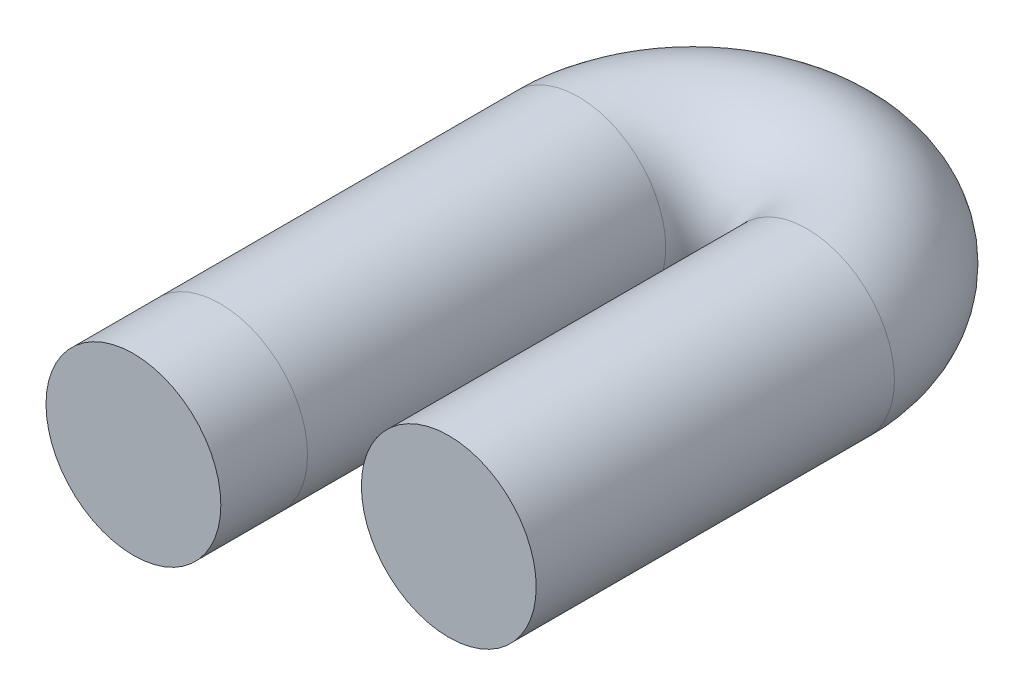
ISO-10303-21;
HEADER;
FILE_DESCRIPTION(('STEP AP214'),'2;1');
FILE_NAME('part.step','',(''),(''),'','','');
FILE_SCHEMA(('AUTOMOTIVE_DESIGN { 1 0 10303 214 1 1 1 1 }'));
ENDSEC;
DATA;
#1=APPLICATION_CONTEXT('core data for automotive mechanical design processes');
#2=APPLICATION_PROTOCOL_DEFINITION('international standard','automotive_design',2000,#1);
#3=PRODUCT_CONTEXT('',#1,'mechanical');
#4=PRODUCT('Part','Part','',(#3));
#5=PRODUCT_RELATED_PRODUCT_CATEGORY('part','',(#4));
#6=PRODUCT_DEFINITION_FORMATION('','',#4);
#7=PRODUCT_DEFINITION_CONTEXT('part definition',#1,'design');
#8=PRODUCT_DEFINITION('design','',#6,#7);
#9=PRODUCT_DEFINITION_SHAPE('','',#8);
#10=(LENGTH_UNIT() NAMED_UNIT(*) SI_UNIT(.MILLI.,.METRE.));
#11=(NAMED_UNIT(*) PLANE_ANGLE_UNIT() SI_UNIT($,.RADIAN.));
#12=(NAMED_UNIT(*) SI_UNIT($,.STERADIAN.) SOLID_ANGLE_UNIT());
#13=UNCERTAINTY_MEASURE_WITH_UNIT(LENGTH_MEASURE(1.E-05),#10,'distance_accuracy_value','');
#14=(GEOMETRIC_REPRESENTATION_CONTEXT(3) GLOBAL_UNCERTAINTY_ASSIGNED_CONTEXT((#13)) GLOBAL_UNIT_ASSIGNED_CONTEXT((#10,
#11,#12)) REPRESENTATION_CONTEXT('',''));
#15=CARTESIAN_POINT('',(0.,0.,0.));
#16=DIRECTION('',(0.,0.,1.));
#17=DIRECTION('',(1.,0.,0.));
#18=AXIS2_PLACEMENT_3D('',#15,#16,#17);
#19=CARTESIAN_POINT('',(0.,0.,0.));
#20=DIRECTION('',(0.,0.,1.));
#21=DIRECTION('',(1.,0.,0.));
#22=AXIS2_PLACEMENT_3D('',#19,#20,#21);
#23=PLANE('',#22);
#24=CARTESIAN_POINT('',(0.,0.,0.));
#25=DIRECTION('',(0.,0.,1.));
#26=DIRECTION('',(1.,0.,0.));
#27=AXIS2_PLACEMENT_3D('',#24,#25,#26);
#28=CIRCLE('',#27,20.9032643742647);
#29=CARTESIAN_POINT('',(20.9032643742647,0.,0.));
#30=VERTEX_POINT('',#29);
#31=EDGE_CURVE('E63',#30,#30,#28,.T.);
#32=ORIENTED_EDGE('',*,*,#31,.T.);
#33=EDGE_LOOP('',(#32));
#34=FACE_BOUND('',#33,.T.);
#35=ADVANCED_FACE('F40',(#34),#23,.T.);
#36=CARTESIAN_POINT('',(54.6840989263719,0.,-20.7306210780018));
#37=DIRECTION('',(0.,0.,-1.));
#38=DIRECTION('',(-1.,0.,0.));
#39=AXIS2_PLACEMENT_3D('',#36,#37,#38);
#40=PLANE('',#39);
#41=CARTESIAN_POINT('',(54.6840989263719,0.,-20.7306210780018));
#42=DIRECTION('',(0.,0.,-1.));
#43=DIRECTION('',(-1.,0.,0.));
#44=AXIS2_PLACEMENT_3D('',#41,#42,#43);
#45=CIRCLE('',#44,20.9032643742647);
#46=CARTESIAN_POINT('',(33.7808345521072,0.,-20.7306210780018));
#47=VERTEX_POINT('',#46);
#48=EDGE_CURVE('E10',#47,#47,#45,.T.);
#49=ORIENTED_EDGE('',*,*,#48,.F.);
#50=EDGE_LOOP('',(#49));
#51=FACE_BOUND('',#50,.T.);
#52=ADVANCED_FACE('F72',(#51),#40,.F.);
#53=CARTESIAN_POINT('',(0.,0.,0.));
#54=DIRECTION('',(0.,0.,-1.));
#55=DIRECTION('',(-1.,0.,0.));
#56=AXIS2_PLACEMENT_3D('',#53,#54,#55);
#57=CYLINDRICAL_SURFACE('',#56,20.9032643742647);
#58=CARTESIAN_POINT('',(0.,0.,-20.7306210780018));
#59=DIRECTION('',(0.,0.,1.));
#60=DIRECTION('',(1.,0.,0.));
#61=AXIS2_PLACEMENT_3D('',#58,#59,#60);
#62=CIRCLE('',#61,20.9032643742647);
#63=CARTESIAN_POINT('',(20.9032643742647,0.,-20.7306210780018));
#64=VERTEX_POINT('',#63);
#65=EDGE_CURVE('E57',#64,#64,#62,.T.);
#66=ORIENTED_EDGE('',*,*,#65,.T.);
#67=EDGE_LOOP('',(#66));
#68=FACE_BOUND('',#67,.T.);
#69=ORIENTED_EDGE('',*,*,#31,.F.);
#70=EDGE_LOOP('',(#69));
#71=FACE_BOUND('',#70,.T.);
#72=ADVANCED_FACE('F69',(#68,#71),#57,.T.);
#73=CARTESIAN_POINT('',(0.,0.,-20.7306210780018));
#74=DIRECTION('',(0.,0.,-1.));
#75=DIRECTION('',(-1.,0.,0.));
#76=AXIS2_PLACEMENT_3D('',#73,#74,#75);
#77=CYLINDRICAL_SURFACE('',#76,20.9032643742647);
#78=CARTESIAN_POINT('',(0.,0.,-106.395646217736));
#79=DIRECTION('',(0.,0.,1.));
#80=DIRECTION('',(1.,0.,0.));
#81=AXIS2_PLACEMENT_3D('',#78,#79,#80);
#82=CIRCLE('',#81,20.9032643742647);
#83=CARTESIAN_POINT('',(-20.9032643742647,0.,-106.395646217736));
#84=VERTEX_POINT('',#83);
#85=EDGE_CURVE('E52',#84,#84,#82,.T.);
#86=ORIENTED_EDGE('',*,*,#85,.T.);
#87=EDGE_LOOP('',(#86));
#88=FACE_BOUND('',#87,.T.);
#89=ORIENTED_EDGE('',*,*,#65,.F.);
#90=EDGE_LOOP('',(#89));
#91=FACE_BOUND('',#90,.T.);
#92=ADVANCED_FACE('F71',(#88,#91),#77,.T.);
#93=CARTESIAN_POINT('',(27.342049463186,0.,-106.395646217736));
#94=DIRECTION('',(0.,-1.,0.));
#95=DIRECTION('',(0.,0.,-1.));
#96=AXIS2_PLACEMENT_3D('',#93,#94,#95);
#97=TOROIDAL_SURFACE('',#96,27.342049463186,20.9032643742647);
#98=CARTESIAN_POINT('',(54.6840989263719,0.,-106.395646217736));
#99=DIRECTION('',(0.,0.,-1.));
#100=DIRECTION('',(-1.,0.,0.));
#101=AXIS2_PLACEMENT_3D('',#98,#99,#100);
#102=CIRCLE('',#101,20.9032643742647);
#103=CARTESIAN_POINT('',(75.5873633006366,0.,-106.395646217736));
#104=VERTEX_POINT('',#103);
#105=EDGE_CURVE('E47',#104,#104,#102,.T.);
#106=CARTESIAN_POINT('',(27.342049463186,0.,-106.395646217736));
#107=DIRECTION('',(0.,-1.,0.));
#108=DIRECTION('',(0.,0.,-1.));
#109=AXIS2_PLACEMENT_3D('',#106,#107,#108);
#110=CIRCLE('',#109,48.2453138374507);
#111=EDGE_CURVE('',#84,#104,#110,.T.);
#112=ORIENTED_EDGE('',*,*,#85,.F.);
#113=ORIENTED_EDGE('',*,*,#105,.T.);
#114=ORIENTED_EDGE('',*,*,#111,.T.);
#115=ORIENTED_EDGE('',*,*,#111,.F.);
#116=EDGE_LOOP('',(#112,#114,#113,#115));
#117=FACE_BOUND('',#116,.T.);
#118=ADVANCED_FACE('F79',(#117),#97,.T.);
#119=CARTESIAN_POINT('',(54.6840989263719,0.,-106.395646217736));
#120=DIRECTION('',(0.,0.,1.));
#121=DIRECTION('',(1.,0.,0.));
#122=AXIS2_PLACEMENT_3D('',#119,#120,#121);
#123=CYLINDRICAL_SURFACE('',#122,20.9032643742647);
#124=ORIENTED_EDGE('',*,*,#48,.T.);
#125=EDGE_LOOP('',(#124));
#126=FACE_BOUND('',#125,.T.);
#127=ORIENTED_EDGE('',*,*,#105,.F.);
#128=EDGE_LOOP('',(#127));
#129=FACE_BOUND('',#128,.T.);
#130=ADVANCED_FACE('F83',(#126,#129),#123,.T.);
#131=CLOSED_SHELL('',(#35,#52,#72,#92,#118,#130));
#132=MANIFOLD_SOLID_BREP('B2',#131);
#133=ADVANCED_BREP_SHAPE_REPRESENTATION('',(#18,#132),#14);
#134=SHAPE_DEFINITION_REPRESENTATION(#9,#133);
ENDSEC;
END-ISO-10303-21;
